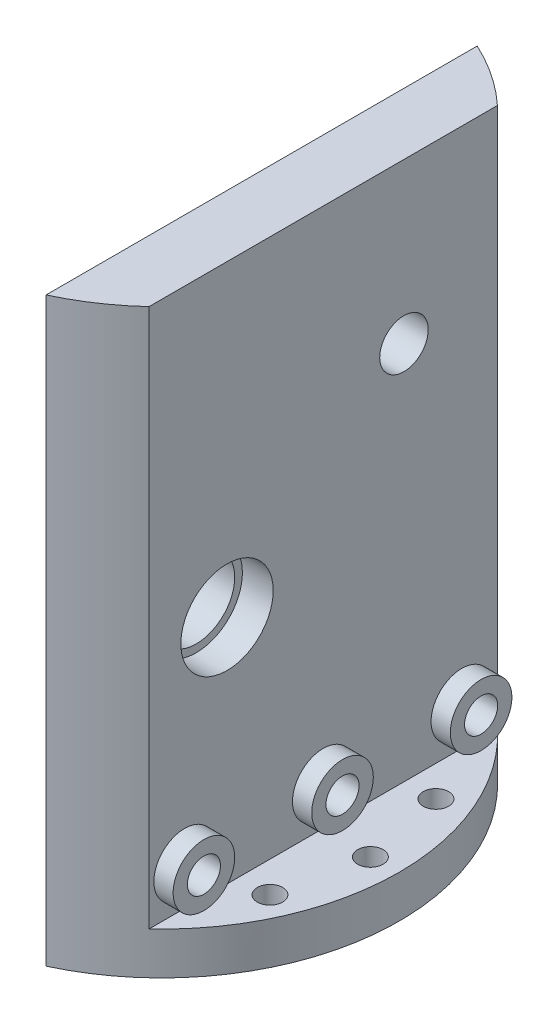
ISO-10303-21;
HEADER;
FILE_DESCRIPTION(('STEP AP214'),'2;1');
FILE_NAME('part.step','',(''),(''),'','','');
FILE_SCHEMA(('AUTOMOTIVE_DESIGN { 1 0 10303 214 1 1 1 1 }'));
ENDSEC;
DATA;
#1=APPLICATION_CONTEXT('core data for automotive mechanical design processes');
#2=APPLICATION_PROTOCOL_DEFINITION('international standard','automotive_design',2000,#1);
#3=PRODUCT_CONTEXT('',#1,'mechanical');
#4=PRODUCT('Part','Part','',(#3));
#5=PRODUCT_RELATED_PRODUCT_CATEGORY('part','',(#4));
#6=PRODUCT_DEFINITION_FORMATION('','',#4);
#7=PRODUCT_DEFINITION_CONTEXT('part definition',#1,'design');
#8=PRODUCT_DEFINITION('design','',#6,#7);
#9=PRODUCT_DEFINITION_SHAPE('','',#8);
#10=(LENGTH_UNIT() NAMED_UNIT(*) SI_UNIT(.MILLI.,.METRE.));
#11=(NAMED_UNIT(*) PLANE_ANGLE_UNIT() SI_UNIT($,.RADIAN.));
#12=(NAMED_UNIT(*) SI_UNIT($,.STERADIAN.) SOLID_ANGLE_UNIT());
#13=UNCERTAINTY_MEASURE_WITH_UNIT(LENGTH_MEASURE(1.E-05),#10,'distance_accuracy_value','');
#14=(GEOMETRIC_REPRESENTATION_CONTEXT(3) GLOBAL_UNCERTAINTY_ASSIGNED_CONTEXT((#13)) GLOBAL_UNIT_ASSIGNED_CONTEXT((#10,
#11,#12)) REPRESENTATION_CONTEXT('',''));
#15=CARTESIAN_POINT('',(0.,0.,0.));
#16=DIRECTION('',(0.,0.,1.));
#17=DIRECTION('',(1.,0.,0.));
#18=AXIS2_PLACEMENT_3D('',#15,#16,#17);
#19=CARTESIAN_POINT('',(45.4999999999997,129.559702969517,0.));
#20=DIRECTION('',(1.,0.,0.));
#21=DIRECTION('',(0.,0.,-1.));
#22=AXIS2_PLACEMENT_3D('',#19,#20,#21);
#23=PLANE('',#22);
#24=CARTESIAN_POINT('',(45.4999999999997,8.,-12.5));
#25=DIRECTION('',(1.,0.,0.));
#26=DIRECTION('',(0.,0.,-1.));
#27=AXIS2_PLACEMENT_3D('',#24,#25,#26);
#28=CIRCLE('',#27,4.);
#29=CARTESIAN_POINT('',(45.4999999999997,8.,-16.5));
#30=VERTEX_POINT('',#29);
#31=EDGE_CURVE('E122',#30,#30,#28,.T.);
#32=ORIENTED_EDGE('',*,*,#31,.F.);
#33=EDGE_LOOP('',(#32));
#34=FACE_BOUND('',#33,.T.);
#35=DIRECTION('',(0.,-1.,0.));
#36=VECTOR('',#35,1.);
#37=CARTESIAN_POINT('',(45.4999999999997,129.559702969517,-35.1218920517271));
#38=LINE('',#37,#36);
#39=CARTESIAN_POINT('',(45.4999999999997,73.,-35.1218920517271));
#40=VERTEX_POINT('',#39);
#41=CARTESIAN_POINT('',(45.4999999999997,3.,-35.1218920517271));
#42=VERTEX_POINT('',#41);
#43=EDGE_CURVE('E95',#40,#42,#38,.T.);
#44=ORIENTED_EDGE('',*,*,#43,.F.);
#45=DIRECTION('',(0.,0.,1.));
#46=VECTOR('',#45,1.);
#47=CARTESIAN_POINT('',(45.4999999999997,73.,0.));
#48=LINE('',#47,#46);
#49=CARTESIAN_POINT('',(45.4999999999997,73.,10.1218920517271));
#50=VERTEX_POINT('',#49);
#51=EDGE_CURVE('E160',#40,#50,#48,.T.);
#52=ORIENTED_EDGE('',*,*,#51,.T.);
#53=DIRECTION('',(0.,-1.,0.));
#54=VECTOR('',#53,1.);
#55=CARTESIAN_POINT('',(45.4999999999997,129.559702969517,10.1218920517271));
#56=LINE('',#55,#54);
#57=CARTESIAN_POINT('',(45.4999999999997,3.,10.1218920517271));
#58=VERTEX_POINT('',#57);
#59=EDGE_CURVE('E162',#50,#58,#56,.T.);
#60=ORIENTED_EDGE('',*,*,#59,.T.);
#61=DIRECTION('',(0.,0.,1.));
#62=VECTOR('',#61,1.);
#63=CARTESIAN_POINT('',(45.4999999999997,3.,0.));
#64=LINE('',#63,#62);
#65=EDGE_CURVE('E161',#42,#58,#64,.T.);
#66=ORIENTED_EDGE('',*,*,#65,.F.);
#67=EDGE_LOOP('',(#44,#52,#60,#66));
#68=FACE_BOUND('',#67,.T.);
#69=CARTESIAN_POINT('',(45.4999999999997,52.283628290596,-22.9813332935694));
#70=DIRECTION('',(1.,0.,0.));
#71=DIRECTION('',(0.,0.,-1.));
#72=AXIS2_PLACEMENT_3D('',#69,#70,#71);
#73=CIRCLE('',#72,3.15);
#74=CARTESIAN_POINT('',(45.4999999999997,52.283628290596,-26.1313332935694));
#75=VERTEX_POINT('',#74);
#76=EDGE_CURVE('E158',#75,#75,#73,.T.);
#77=ORIENTED_EDGE('',*,*,#76,.F.);
#78=EDGE_LOOP('',(#77));
#79=FACE_BOUND('',#78,.T.);
#80=CARTESIAN_POINT('',(45.4999999999997,33.,0.));
#81=DIRECTION('',(1.,0.,0.));
#82=DIRECTION('',(0.,0.,-1.));
#83=AXIS2_PLACEMENT_3D('',#80,#81,#82);
#84=CIRCLE('',#83,6.);
#85=CARTESIAN_POINT('',(45.4999999999997,33.,-6.));
#86=VERTEX_POINT('',#85);
#87=EDGE_CURVE('E150',#86,#86,#84,.T.);
#88=ORIENTED_EDGE('',*,*,#87,.F.);
#89=EDGE_LOOP('',(#88));
#90=FACE_BOUND('',#89,.T.);
#91=CARTESIAN_POINT('',(45.4999999999997,8.,5.5));
#92=DIRECTION('',(1.,0.,0.));
#93=DIRECTION('',(0.,0.,-1.));
#94=AXIS2_PLACEMENT_3D('',#91,#92,#93);
#95=CIRCLE('',#94,4.);
#96=CARTESIAN_POINT('',(45.4999999999997,8.,1.5));
#97=VERTEX_POINT('',#96);
#98=EDGE_CURVE('E131',#97,#97,#95,.T.);
#99=ORIENTED_EDGE('',*,*,#98,.F.);
#100=EDGE_LOOP('',(#99));
#101=FACE_BOUND('',#100,.T.);
#102=CARTESIAN_POINT('',(45.4999999999997,8.,-30.5));
#103=DIRECTION('',(1.,0.,0.));
#104=DIRECTION('',(0.,0.,-1.));
#105=AXIS2_PLACEMENT_3D('',#102,#103,#104);
#106=CIRCLE('',#105,4.);
#107=CARTESIAN_POINT('',(45.4999999999997,8.,-34.5));
#108=VERTEX_POINT('',#107);
#109=EDGE_CURVE('E113',#108,#108,#106,.T.);
#110=ORIENTED_EDGE('',*,*,#109,.F.);
#111=EDGE_LOOP('',(#110));
#112=FACE_BOUND('',#111,.T.);
#113=ADVANCED_FACE('F45',(#34,#68,#79,#90,#101,#112),#23,.T.);
#114=CARTESIAN_POINT('',(41.4999999999997,33.,0.));
#115=DIRECTION('',(1.,0.,0.));
#116=DIRECTION('',(0.,0.,-1.));
#117=AXIS2_PLACEMENT_3D('',#114,#115,#116);
#118=PLANE('',#117);
#119=CARTESIAN_POINT('',(41.4999999999997,33.,0.));
#120=DIRECTION('',(1.,0.,0.));
#121=DIRECTION('',(0.,0.,-1.));
#122=AXIS2_PLACEMENT_3D('',#119,#120,#121);
#123=CIRCLE('',#122,6.);
#124=CARTESIAN_POINT('',(41.4999999999997,33.,-6.));
#125=VERTEX_POINT('',#124);
#126=EDGE_CURVE('E141',#125,#125,#123,.T.);
#127=ORIENTED_EDGE('',*,*,#126,.T.);
#128=EDGE_LOOP('',(#127));
#129=FACE_BOUND('',#128,.T.);
#130=CARTESIAN_POINT('',(41.4999999999997,33.,0.));
#131=DIRECTION('',(1.,0.,0.));
#132=DIRECTION('',(0.,0.,-1.));
#133=AXIS2_PLACEMENT_3D('',#130,#131,#132);
#134=CIRCLE('',#133,5.);
#135=CARTESIAN_POINT('',(41.4999999999997,33.,-5.));
#136=VERTEX_POINT('',#135);
#137=EDGE_CURVE('E147',#136,#136,#134,.F.);
#138=ORIENTED_EDGE('',*,*,#137,.T.);
#139=EDGE_LOOP('',(#138));
#140=FACE_BOUND('',#139,.T.);
#141=ADVANCED_FACE('F47',(#129,#140),#118,.T.);
#142=CARTESIAN_POINT('',(41.4999999999997,33.,0.));
#143=DIRECTION('',(1.,0.,0.));
#144=DIRECTION('',(0.,0.,-1.));
#145=AXIS2_PLACEMENT_3D('',#142,#143,#144);
#146=CYLINDRICAL_SURFACE('',#145,6.);
#147=ORIENTED_EDGE('',*,*,#126,.F.);
#148=EDGE_LOOP('',(#147));
#149=FACE_BOUND('',#148,.T.);
#150=ORIENTED_EDGE('',*,*,#87,.T.);
#151=EDGE_LOOP('',(#150));
#152=FACE_BOUND('',#151,.T.);
#153=ADVANCED_FACE('F188',(#149,#152),#146,.F.);
#154=CARTESIAN_POINT('',(46.4999999999998,52.283628290596,-22.9813332935694));
#155=DIRECTION('',(-1.,0.,0.));
#156=DIRECTION('',(0.,0.,1.));
#157=AXIS2_PLACEMENT_3D('',#154,#155,#156);
#158=CYLINDRICAL_SURFACE('',#157,3.15);
#159=ORIENTED_EDGE('',*,*,#76,.T.);
#160=EDGE_LOOP('',(#159));
#161=FACE_BOUND('',#160,.T.);
#162=CARTESIAN_POINT('',(37.4999999999998,52.283628290596,-22.9813332935694));
#163=DIRECTION('',(-1.,0.,0.));
#164=DIRECTION('',(0.,0.,1.));
#165=AXIS2_PLACEMENT_3D('',#162,#163,#164);
#166=CIRCLE('',#165,3.15);
#167=CARTESIAN_POINT('',(37.4999999999998,52.283628290596,-19.8313332935694));
#168=VERTEX_POINT('',#167);
#169=EDGE_CURVE('E155',#168,#168,#166,.T.);
#170=ORIENTED_EDGE('',*,*,#169,.T.);
#171=EDGE_LOOP('',(#170));
#172=FACE_BOUND('',#171,.T.);
#173=ADVANCED_FACE('F191',(#161,#172),#158,.F.);
#174=CARTESIAN_POINT('',(35.4999999999997,33.,0.));
#175=DIRECTION('',(1.,0.,0.));
#176=DIRECTION('',(0.,0.,-1.));
#177=AXIS2_PLACEMENT_3D('',#174,#175,#176);
#178=CYLINDRICAL_SURFACE('',#177,5.);
#179=CARTESIAN_POINT('',(37.4999999999998,33.,0.));
#180=DIRECTION('',(-1.,0.,0.));
#181=DIRECTION('',(0.,0.,1.));
#182=AXIS2_PLACEMENT_3D('',#179,#180,#181);
#183=CIRCLE('',#182,5.);
#184=CARTESIAN_POINT('',(37.4999999999998,33.,5.));
#185=VERTEX_POINT('',#184);
#186=EDGE_CURVE('E151',#185,#185,#183,.T.);
#187=ORIENTED_EDGE('',*,*,#186,.T.);
#188=EDGE_LOOP('',(#187));
#189=FACE_BOUND('',#188,.T.);
#190=ORIENTED_EDGE('',*,*,#137,.F.);
#191=EDGE_LOOP('',(#190));
#192=FACE_BOUND('',#191,.T.);
#193=ADVANCED_FACE('F268',(#189,#192),#178,.F.);
#194=CARTESIAN_POINT('',(49.5035629256171,-36.,-23.1304170397046));
#195=DIRECTION('',(0.,1.,0.));
#196=DIRECTION('',(0.,0.,1.));
#197=AXIS2_PLACEMENT_3D('',#194,#195,#196);
#198=CYLINDRICAL_SURFACE('',#197,1.65);
#199=CARTESIAN_POINT('',(49.5035629256171,3.,-23.1304170397046));
#200=DIRECTION('',(0.,1.,0.));
#201=DIRECTION('',(0.,0.,1.));
#202=AXIS2_PLACEMENT_3D('',#199,#200,#201);
#203=CIRCLE('',#202,1.65);
#204=CARTESIAN_POINT('',(49.5035629256171,3.,-21.4804170397046));
#205=VERTEX_POINT('',#204);
#206=EDGE_CURVE('E154',#205,#205,#203,.T.);
#207=ORIENTED_EDGE('',*,*,#206,.T.);
#208=EDGE_LOOP('',(#207));
#209=FACE_BOUND('',#208,.T.);
#210=CARTESIAN_POINT('',(49.5035629256171,-2.5,-23.1304170397046));
#211=DIRECTION('',(0.,-1.,0.));
#212=DIRECTION('',(0.,0.,-1.));
#213=AXIS2_PLACEMENT_3D('',#210,#211,#212);
#214=CIRCLE('',#213,1.65);
#215=CARTESIAN_POINT('',(49.5035629256171,-2.5,-24.7804170397046));
#216=VERTEX_POINT('',#215);
#217=EDGE_CURVE('E482',#216,#216,#214,.T.);
#218=ORIENTED_EDGE('',*,*,#217,.T.);
#219=EDGE_LOOP('',(#218));
#220=FACE_BOUND('',#219,.T.);
#221=ADVANCED_FACE('F262',(#209,#220),#198,.F.);
#222=CARTESIAN_POINT('',(51.7681904560943,-36.,-12.3520800029353));
#223=DIRECTION('',(0.,1.,0.));
#224=DIRECTION('',(0.,0.,1.));
#225=AXIS2_PLACEMENT_3D('',#222,#223,#224);
#226=CYLINDRICAL_SURFACE('',#225,1.65);
#227=CARTESIAN_POINT('',(51.7681904560943,3.,-12.3520800029353));
#228=DIRECTION('',(0.,1.,0.));
#229=DIRECTION('',(0.,0.,1.));
#230=AXIS2_PLACEMENT_3D('',#227,#228,#229);
#231=CIRCLE('',#230,1.65);
#232=CARTESIAN_POINT('',(51.7681904560943,3.,-10.7020800029353));
#233=VERTEX_POINT('',#232);
#234=EDGE_CURVE('E173',#233,#233,#231,.T.);
#235=ORIENTED_EDGE('',*,*,#234,.T.);
#236=EDGE_LOOP('',(#235));
#237=FACE_BOUND('',#236,.T.);
#238=CARTESIAN_POINT('',(51.7681904560943,-2.5,-12.3520800029353));
#239=DIRECTION('',(0.,-1.,0.));
#240=DIRECTION('',(0.,0.,-1.));
#241=AXIS2_PLACEMENT_3D('',#238,#239,#240);
#242=CIRCLE('',#241,1.65);
#243=CARTESIAN_POINT('',(51.7681904560943,-2.5,-14.0020800029353));
#244=VERTEX_POINT('',#243);
#245=EDGE_CURVE('E107',#244,#244,#242,.T.);
#246=ORIENTED_EDGE('',*,*,#245,.T.);
#247=EDGE_LOOP('',(#246));
#248=FACE_BOUND('',#247,.T.);
#249=ADVANCED_FACE('F259',(#237,#248),#226,.F.);
#250=CARTESIAN_POINT('',(49.5035629256171,-36.,-1.57374296616599));
#251=DIRECTION('',(0.,1.,0.));
#252=DIRECTION('',(0.,0.,1.));
#253=AXIS2_PLACEMENT_3D('',#250,#251,#252);
#254=CYLINDRICAL_SURFACE('',#253,1.65);
#255=CARTESIAN_POINT('',(49.5035629256171,3.,-1.57374296616599));
#256=DIRECTION('',(0.,1.,0.));
#257=DIRECTION('',(0.,0.,1.));
#258=AXIS2_PLACEMENT_3D('',#255,#256,#257);
#259=CIRCLE('',#258,1.65);
#260=CARTESIAN_POINT('',(49.5035629256171,3.,0.0762570338340074));
#261=VERTEX_POINT('',#260);
#262=EDGE_CURVE('E172',#261,#261,#259,.T.);
#263=ORIENTED_EDGE('',*,*,#262,.T.);
#264=EDGE_LOOP('',(#263));
#265=FACE_BOUND('',#264,.T.);
#266=CARTESIAN_POINT('',(49.5035629256171,-2.5,-1.57374296616599));
#267=DIRECTION('',(0.,-1.,0.));
#268=DIRECTION('',(0.,0.,-1.));
#269=AXIS2_PLACEMENT_3D('',#266,#267,#268);
#270=CIRCLE('',#269,1.65);
#271=CARTESIAN_POINT('',(49.5035629256171,-2.5,-3.223742966166));
#272=VERTEX_POINT('',#271);
#273=EDGE_CURVE('E104',#272,#272,#270,.T.);
#274=ORIENTED_EDGE('',*,*,#273,.T.);
#275=EDGE_LOOP('',(#274));
#276=FACE_BOUND('',#275,.T.);
#277=ADVANCED_FACE('F249',(#265,#276),#254,.F.);
#278=CARTESIAN_POINT('',(20.,3.,-12.5));
#279=DIRECTION('',(0.,1.,0.));
#280=DIRECTION('',(0.,0.,1.));
#281=AXIS2_PLACEMENT_3D('',#278,#279,#280);
#282=PLANE('',#281);
#283=ORIENTED_EDGE('',*,*,#206,.F.);
#284=EDGE_LOOP('',(#283));
#285=FACE_BOUND('',#284,.T.);
#286=ORIENTED_EDGE('',*,*,#234,.F.);
#287=EDGE_LOOP('',(#286));
#288=FACE_BOUND('',#287,.T.);
#289=ORIENTED_EDGE('',*,*,#262,.F.);
#290=EDGE_LOOP('',(#289));
#291=FACE_BOUND('',#290,.T.);
#292=ORIENTED_EDGE('',*,*,#65,.T.);
#293=CARTESIAN_POINT('',(24.4999999999997,3.,-12.5));
#294=DIRECTION('',(0.,1.,0.));
#295=DIRECTION('',(0.,0.,1.));
#296=AXIS2_PLACEMENT_3D('',#293,#294,#295);
#297=CIRCLE('',#296,30.8666486681012);
#298=EDGE_CURVE('E81',#58,#42,#297,.T.);
#299=ORIENTED_EDGE('',*,*,#298,.T.);
#300=EDGE_LOOP('',(#292,#299));
#301=FACE_BOUND('',#300,.T.);
#302=ADVANCED_FACE('F245',(#285,#288,#291,#301),#282,.T.);
#303=CARTESIAN_POINT('',(0.,73.,0.));
#304=DIRECTION('',(0.,1.,0.));
#305=DIRECTION('',(0.,0.,1.));
#306=AXIS2_PLACEMENT_3D('',#303,#304,#305);
#307=PLANE('',#306);
#308=ORIENTED_EDGE('',*,*,#51,.F.);
#309=CARTESIAN_POINT('',(24.4999999999997,73.,-12.5));
#310=DIRECTION('',(0.,1.,0.));
#311=DIRECTION('',(0.,0.,1.));
#312=AXIS2_PLACEMENT_3D('',#309,#310,#311);
#313=CIRCLE('',#312,30.8666486681012);
#314=CARTESIAN_POINT('',(37.4999999999998,73.,-40.4955353583387));
#315=VERTEX_POINT('',#314);
#316=EDGE_CURVE('E72',#40,#315,#313,.T.);
#317=ORIENTED_EDGE('',*,*,#316,.T.);
#318=DIRECTION('',(0.,0.,-1.));
#319=VECTOR('',#318,1.);
#320=CARTESIAN_POINT('',(37.4999999999998,73.,0.));
#321=LINE('',#320,#319);
#322=CARTESIAN_POINT('',(37.4999999999997,73.,15.4955353583387));
#323=VERTEX_POINT('',#322);
#324=EDGE_CURVE('E55',#323,#315,#321,.T.);
#325=ORIENTED_EDGE('',*,*,#324,.F.);
#326=CARTESIAN_POINT('',(24.4999999999997,73.,-12.5));
#327=DIRECTION('',(0.,1.,0.));
#328=DIRECTION('',(0.,0.,1.));
#329=AXIS2_PLACEMENT_3D('',#326,#327,#328);
#330=CIRCLE('',#329,30.8666486681012);
#331=EDGE_CURVE('E94',#323,#50,#330,.T.);
#332=ORIENTED_EDGE('',*,*,#331,.T.);
#333=EDGE_LOOP('',(#308,#317,#325,#332));
#334=FACE_BOUND('',#333,.T.);
#335=ADVANCED_FACE('F248',(#334),#307,.T.);
#336=CARTESIAN_POINT('',(24.4999999999997,-36.,-12.5));
#337=DIRECTION('',(0.,1.,0.));
#338=DIRECTION('',(0.,0.,1.));
#339=AXIS2_PLACEMENT_3D('',#336,#337,#338);
#340=CYLINDRICAL_SURFACE('',#339,30.8666486681012);
#341=DIRECTION('',(0.,-1.,0.));
#342=VECTOR('',#341,1.);
#343=CARTESIAN_POINT('',(37.4999999999997,85.,15.4955353583387));
#344=LINE('',#343,#342);
#345=CARTESIAN_POINT('',(37.4999999999997,-2.5,15.4955353583387));
#346=VERTEX_POINT('',#345);
#347=EDGE_CURVE('E49',#323,#346,#344,.T.);
#348=ORIENTED_EDGE('',*,*,#347,.T.);
#349=CARTESIAN_POINT('',(24.4999999999997,-2.5,-12.5));
#350=DIRECTION('',(0.,-1.,0.));
#351=DIRECTION('',(0.,0.,1.));
#352=AXIS2_PLACEMENT_3D('',#349,#350,#351);
#353=CIRCLE('',#352,30.8666486681012);
#354=CARTESIAN_POINT('',(37.4999999999998,-2.5,-40.4955353583387));
#355=VERTEX_POINT('',#354);
#356=EDGE_CURVE('E92',#355,#346,#353,.T.);
#357=ORIENTED_EDGE('',*,*,#356,.F.);
#358=DIRECTION('',(0.,-1.,0.));
#359=VECTOR('',#358,1.);
#360=CARTESIAN_POINT('',(37.4999999999998,129.559702969517,-40.4955353583387));
#361=LINE('',#360,#359);
#362=EDGE_CURVE('E12',#315,#355,#361,.T.);
#363=ORIENTED_EDGE('',*,*,#362,.F.);
#364=ORIENTED_EDGE('',*,*,#316,.F.);
#365=ORIENTED_EDGE('',*,*,#43,.T.);
#366=ORIENTED_EDGE('',*,*,#298,.F.);
#367=ORIENTED_EDGE('',*,*,#59,.F.);
#368=ORIENTED_EDGE('',*,*,#331,.F.);
#369=EDGE_LOOP('',(#348,#357,#363,#364,#365,#366,#367,#368));
#370=FACE_BOUND('',#369,.T.);
#371=ADVANCED_FACE('F90',(#370),#340,.T.);
#372=CARTESIAN_POINT('',(37.4999999999998,129.559702969517,0.));
#373=DIRECTION('',(-1.,0.,0.));
#374=DIRECTION('',(0.,0.,1.));
#375=AXIS2_PLACEMENT_3D('',#372,#373,#374);
#376=PLANE('',#375);
#377=CARTESIAN_POINT('',(37.4999999999998,8.,-30.5));
#378=DIRECTION('',(-1.,0.,0.));
#379=DIRECTION('',(0.,0.,1.));
#380=AXIS2_PLACEMENT_3D('',#377,#378,#379);
#381=CIRCLE('',#380,2.15);
#382=CARTESIAN_POINT('',(37.4999999999998,8.,-28.35));
#383=VERTEX_POINT('',#382);
#384=EDGE_CURVE('E138',#383,#383,#381,.T.);
#385=ORIENTED_EDGE('',*,*,#384,.F.);
#386=EDGE_LOOP('',(#385));
#387=FACE_BOUND('',#386,.T.);
#388=CARTESIAN_POINT('',(37.4999999999998,8.,-12.5));
#389=DIRECTION('',(-1.,0.,0.));
#390=DIRECTION('',(0.,0.,1.));
#391=AXIS2_PLACEMENT_3D('',#388,#389,#390);
#392=CIRCLE('',#391,2.15);
#393=CARTESIAN_POINT('',(37.4999999999998,8.,-10.35));
#394=VERTEX_POINT('',#393);
#395=EDGE_CURVE('E142',#394,#394,#392,.T.);
#396=ORIENTED_EDGE('',*,*,#395,.F.);
#397=EDGE_LOOP('',(#396));
#398=FACE_BOUND('',#397,.T.);
#399=CARTESIAN_POINT('',(37.4999999999998,8.,5.5));
#400=DIRECTION('',(-1.,0.,0.));
#401=DIRECTION('',(0.,0.,1.));
#402=AXIS2_PLACEMENT_3D('',#399,#400,#401);
#403=CIRCLE('',#402,2.15);
#404=CARTESIAN_POINT('',(37.4999999999998,8.,7.65));
#405=VERTEX_POINT('',#404);
#406=EDGE_CURVE('E135',#405,#405,#403,.T.);
#407=ORIENTED_EDGE('',*,*,#406,.F.);
#408=EDGE_LOOP('',(#407));
#409=FACE_BOUND('',#408,.T.);
#410=ORIENTED_EDGE('',*,*,#186,.F.);
#411=EDGE_LOOP('',(#410));
#412=FACE_BOUND('',#411,.T.);
#413=ORIENTED_EDGE('',*,*,#169,.F.);
#414=EDGE_LOOP('',(#413));
#415=FACE_BOUND('',#414,.T.);
#416=ORIENTED_EDGE('',*,*,#347,.F.);
#417=ORIENTED_EDGE('',*,*,#324,.T.);
#418=ORIENTED_EDGE('',*,*,#362,.T.);
#419=DIRECTION('',(0.,0.,-1.));
#420=VECTOR('',#419,1.);
#421=CARTESIAN_POINT('',(37.4999999999997,-2.5,15.4955353583387));
#422=LINE('',#421,#420);
#423=EDGE_CURVE('E97',#346,#355,#422,.T.);
#424=ORIENTED_EDGE('',*,*,#423,.F.);
#425=EDGE_LOOP('',(#416,#417,#418,#424));
#426=FACE_BOUND('',#425,.T.);
#427=ADVANCED_FACE('F98',(#387,#398,#409,#412,#415,#426),#376,.T.);
#428=CARTESIAN_POINT('',(47.4999999999998,8.,5.5));
#429=DIRECTION('',(-1.,0.,0.));
#430=DIRECTION('',(0.,0.,1.));
#431=AXIS2_PLACEMENT_3D('',#428,#429,#430);
#432=CYLINDRICAL_SURFACE('',#431,2.15);
#433=ORIENTED_EDGE('',*,*,#406,.T.);
#434=EDGE_LOOP('',(#433));
#435=FACE_BOUND('',#434,.T.);
#436=CARTESIAN_POINT('',(47.9999999999997,8.,5.5));
#437=DIRECTION('',(1.,0.,0.));
#438=DIRECTION('',(0.,0.,-1.));
#439=AXIS2_PLACEMENT_3D('',#436,#437,#438);
#440=CIRCLE('',#439,2.15);
#441=CARTESIAN_POINT('',(47.9999999999997,8.,3.35));
#442=VERTEX_POINT('',#441);
#443=EDGE_CURVE('E126',#442,#442,#440,.T.);
#444=ORIENTED_EDGE('',*,*,#443,.T.);
#445=EDGE_LOOP('',(#444));
#446=FACE_BOUND('',#445,.T.);
#447=ADVANCED_FACE('F240',(#435,#446),#432,.F.);
#448=CARTESIAN_POINT('',(47.4999999999998,8.,-12.5));
#449=DIRECTION('',(-1.,0.,0.));
#450=DIRECTION('',(0.,0.,1.));
#451=AXIS2_PLACEMENT_3D('',#448,#449,#450);
#452=CYLINDRICAL_SURFACE('',#451,2.15);
#453=ORIENTED_EDGE('',*,*,#395,.T.);
#454=EDGE_LOOP('',(#453));
#455=FACE_BOUND('',#454,.T.);
#456=CARTESIAN_POINT('',(47.9999999999997,8.,-12.5));
#457=DIRECTION('',(1.,0.,0.));
#458=DIRECTION('',(0.,0.,-1.));
#459=AXIS2_PLACEMENT_3D('',#456,#457,#458);
#460=CIRCLE('',#459,2.15);
#461=CARTESIAN_POINT('',(47.9999999999997,8.,-14.65));
#462=VERTEX_POINT('',#461);
#463=EDGE_CURVE('E117',#462,#462,#460,.T.);
#464=ORIENTED_EDGE('',*,*,#463,.T.);
#465=EDGE_LOOP('',(#464));
#466=FACE_BOUND('',#465,.T.);
#467=ADVANCED_FACE('F236',(#455,#466),#452,.F.);
#468=CARTESIAN_POINT('',(47.4999999999998,8.,-30.5));
#469=DIRECTION('',(-1.,0.,0.));
#470=DIRECTION('',(0.,0.,1.));
#471=AXIS2_PLACEMENT_3D('',#468,#469,#470);
#472=CYLINDRICAL_SURFACE('',#471,2.15);
#473=ORIENTED_EDGE('',*,*,#384,.T.);
#474=EDGE_LOOP('',(#473));
#475=FACE_BOUND('',#474,.T.);
#476=CARTESIAN_POINT('',(47.9999999999997,8.,-30.5));
#477=DIRECTION('',(1.,0.,0.));
#478=DIRECTION('',(0.,0.,-1.));
#479=AXIS2_PLACEMENT_3D('',#476,#477,#478);
#480=CIRCLE('',#479,2.15);
#481=CARTESIAN_POINT('',(47.9999999999997,8.,-32.65));
#482=VERTEX_POINT('',#481);
#483=EDGE_CURVE('E100',#482,#482,#480,.T.);
#484=ORIENTED_EDGE('',*,*,#483,.T.);
#485=EDGE_LOOP('',(#484));
#486=FACE_BOUND('',#485,.T.);
#487=ADVANCED_FACE('F229',(#475,#486),#472,.F.);
#488=CARTESIAN_POINT('',(47.9999999999997,8.,5.5));
#489=DIRECTION('',(1.,0.,0.));
#490=DIRECTION('',(0.,0.,-1.));
#491=AXIS2_PLACEMENT_3D('',#488,#489,#490);
#492=PLANE('',#491);
#493=CARTESIAN_POINT('',(47.9999999999997,8.,5.5));
#494=DIRECTION('',(1.,0.,0.));
#495=DIRECTION('',(0.,0.,-1.));
#496=AXIS2_PLACEMENT_3D('',#493,#494,#495);
#497=CIRCLE('',#496,4.);
#498=CARTESIAN_POINT('',(47.9999999999997,8.,1.5));
#499=VERTEX_POINT('',#498);
#500=EDGE_CURVE('E132',#499,#499,#497,.T.);
#501=ORIENTED_EDGE('',*,*,#500,.T.);
#502=EDGE_LOOP('',(#501));
#503=FACE_BOUND('',#502,.T.);
#504=ORIENTED_EDGE('',*,*,#443,.F.);
#505=EDGE_LOOP('',(#504));
#506=FACE_BOUND('',#505,.T.);
#507=ADVANCED_FACE('F226',(#503,#506),#492,.T.);
#508=CARTESIAN_POINT('',(47.9999999999997,8.,5.5));
#509=DIRECTION('',(-1.,0.,0.));
#510=DIRECTION('',(0.,0.,1.));
#511=AXIS2_PLACEMENT_3D('',#508,#509,#510);
#512=CYLINDRICAL_SURFACE('',#511,4.);
#513=ORIENTED_EDGE('',*,*,#500,.F.);
#514=EDGE_LOOP('',(#513));
#515=FACE_BOUND('',#514,.T.);
#516=ORIENTED_EDGE('',*,*,#98,.T.);
#517=EDGE_LOOP('',(#516));
#518=FACE_BOUND('',#517,.T.);
#519=ADVANCED_FACE('F221',(#515,#518),#512,.T.);
#520=CARTESIAN_POINT('',(47.9999999999997,8.,-12.5));
#521=DIRECTION('',(1.,0.,0.));
#522=DIRECTION('',(0.,0.,-1.));
#523=AXIS2_PLACEMENT_3D('',#520,#521,#522);
#524=PLANE('',#523);
#525=CARTESIAN_POINT('',(47.9999999999997,8.,-12.5));
#526=DIRECTION('',(1.,0.,0.));
#527=DIRECTION('',(0.,0.,-1.));
#528=AXIS2_PLACEMENT_3D('',#525,#526,#527);
#529=CIRCLE('',#528,4.);
#530=CARTESIAN_POINT('',(47.9999999999997,8.,-16.5));
#531=VERTEX_POINT('',#530);
#532=EDGE_CURVE('E123',#531,#531,#529,.T.);
#533=ORIENTED_EDGE('',*,*,#532,.T.);
#534=EDGE_LOOP('',(#533));
#535=FACE_BOUND('',#534,.T.);
#536=ORIENTED_EDGE('',*,*,#463,.F.);
#537=EDGE_LOOP('',(#536));
#538=FACE_BOUND('',#537,.T.);
#539=ADVANCED_FACE('F218',(#535,#538),#524,.T.);
#540=CARTESIAN_POINT('',(47.9999999999997,8.,-12.5));
#541=DIRECTION('',(-1.,0.,0.));
#542=DIRECTION('',(0.,0.,1.));
#543=AXIS2_PLACEMENT_3D('',#540,#541,#542);
#544=CYLINDRICAL_SURFACE('',#543,4.);
#545=ORIENTED_EDGE('',*,*,#532,.F.);
#546=EDGE_LOOP('',(#545));
#547=FACE_BOUND('',#546,.T.);
#548=ORIENTED_EDGE('',*,*,#31,.T.);
#549=EDGE_LOOP('',(#548));
#550=FACE_BOUND('',#549,.T.);
#551=ADVANCED_FACE('F213',(#547,#550),#544,.T.);
#552=CARTESIAN_POINT('',(47.9999999999997,8.,-30.5));
#553=DIRECTION('',(1.,0.,0.));
#554=DIRECTION('',(0.,0.,-1.));
#555=AXIS2_PLACEMENT_3D('',#552,#553,#554);
#556=PLANE('',#555);
#557=CARTESIAN_POINT('',(47.9999999999997,8.,-30.5));
#558=DIRECTION('',(1.,0.,0.));
#559=DIRECTION('',(0.,0.,-1.));
#560=AXIS2_PLACEMENT_3D('',#557,#558,#559);
#561=CIRCLE('',#560,4.);
#562=CARTESIAN_POINT('',(47.9999999999997,8.,-34.5));
#563=VERTEX_POINT('',#562);
#564=EDGE_CURVE('E114',#563,#563,#561,.T.);
#565=ORIENTED_EDGE('',*,*,#564,.T.);
#566=EDGE_LOOP('',(#565));
#567=FACE_BOUND('',#566,.T.);
#568=ORIENTED_EDGE('',*,*,#483,.F.);
#569=EDGE_LOOP('',(#568));
#570=FACE_BOUND('',#569,.T.);
#571=ADVANCED_FACE('F204',(#567,#570),#556,.T.);
#572=CARTESIAN_POINT('',(47.9999999999997,8.,-30.5));
#573=DIRECTION('',(-1.,0.,0.));
#574=DIRECTION('',(0.,0.,1.));
#575=AXIS2_PLACEMENT_3D('',#572,#573,#574);
#576=CYLINDRICAL_SURFACE('',#575,4.);
#577=ORIENTED_EDGE('',*,*,#564,.F.);
#578=EDGE_LOOP('',(#577));
#579=FACE_BOUND('',#578,.T.);
#580=ORIENTED_EDGE('',*,*,#109,.T.);
#581=EDGE_LOOP('',(#580));
#582=FACE_BOUND('',#581,.T.);
#583=ADVANCED_FACE('F202',(#579,#582),#576,.T.);
#584=CARTESIAN_POINT('',(24.4999999999997,-2.5,-12.5));
#585=DIRECTION('',(0.,1.,0.));
#586=DIRECTION('',(0.,0.,1.));
#587=AXIS2_PLACEMENT_3D('',#584,#585,#586);
#588=PLANE('',#587);
#589=ORIENTED_EDGE('',*,*,#356,.T.);
#590=ORIENTED_EDGE('',*,*,#423,.T.);
#591=EDGE_LOOP('',(#589,#590));
#592=FACE_BOUND('',#591,.T.);
#593=ORIENTED_EDGE('',*,*,#273,.F.);
#594=EDGE_LOOP('',(#593));
#595=FACE_BOUND('',#594,.T.);
#596=ORIENTED_EDGE('',*,*,#245,.F.);
#597=EDGE_LOOP('',(#596));
#598=FACE_BOUND('',#597,.T.);
#599=ORIENTED_EDGE('',*,*,#217,.F.);
#600=EDGE_LOOP('',(#599));
#601=FACE_BOUND('',#600,.T.);
#602=ADVANCED_FACE('F102',(#592,#595,#598,#601),#588,.F.);
#603=CLOSED_SHELL('',(#113,#141,#153,#173,#193,#221,#249,#277,#302,#335,#371,#427,#447,#467,
#487,#507,#519,#539,#551,#571,#583,#602));
#604=MANIFOLD_SOLID_BREP('B2',#603);
#605=ADVANCED_BREP_SHAPE_REPRESENTATION('',(#18,#604),#14);
#606=SHAPE_DEFINITION_REPRESENTATION(#9,#605);
ENDSEC;
END-ISO-10303-21;
